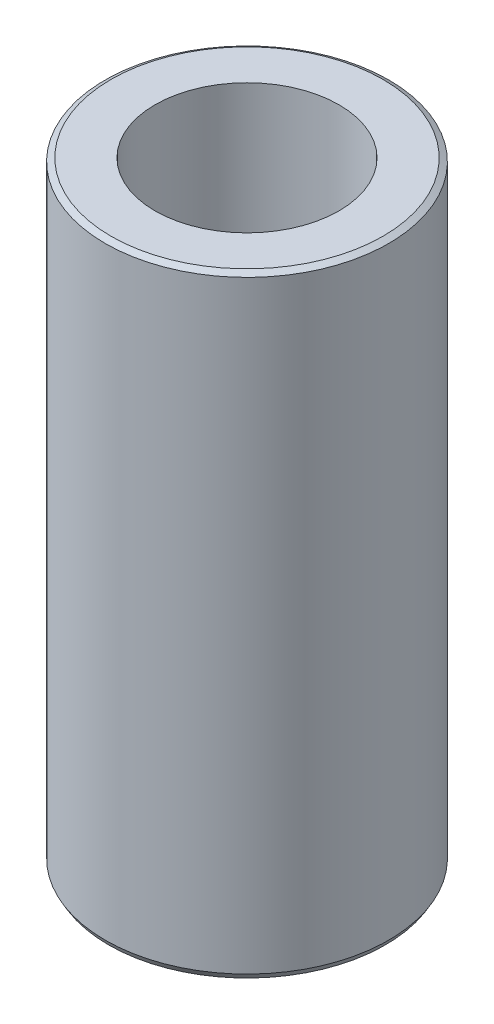
ISO-10303-21;
HEADER;
FILE_DESCRIPTION(('STEP AP214'),'2;1');
FILE_NAME('part.step','',(''),(''),'','','');
FILE_SCHEMA(('AUTOMOTIVE_DESIGN { 1 0 10303 214 1 1 1 1 }'));
ENDSEC;
DATA;
#1=APPLICATION_CONTEXT('core data for automotive mechanical design processes');
#2=APPLICATION_PROTOCOL_DEFINITION('international standard','automotive_design',2000,#1);
#3=PRODUCT_CONTEXT('',#1,'mechanical');
#4=PRODUCT('Part','Part','',(#3));
#5=PRODUCT_RELATED_PRODUCT_CATEGORY('part','',(#4));
#6=PRODUCT_DEFINITION_FORMATION('','',#4);
#7=PRODUCT_DEFINITION_CONTEXT('part definition',#1,'design');
#8=PRODUCT_DEFINITION('design','',#6,#7);
#9=PRODUCT_DEFINITION_SHAPE('','',#8);
#10=(LENGTH_UNIT() NAMED_UNIT(*) SI_UNIT(.MILLI.,.METRE.));
#11=(NAMED_UNIT(*) PLANE_ANGLE_UNIT() SI_UNIT($,.RADIAN.));
#12=(NAMED_UNIT(*) SI_UNIT($,.STERADIAN.) SOLID_ANGLE_UNIT());
#13=UNCERTAINTY_MEASURE_WITH_UNIT(LENGTH_MEASURE(1.E-05),#10,'distance_accuracy_value','');
#14=(GEOMETRIC_REPRESENTATION_CONTEXT(3) GLOBAL_UNCERTAINTY_ASSIGNED_CONTEXT((#13)) GLOBAL_UNIT_ASSIGNED_CONTEXT((#10,
#11,#12)) REPRESENTATION_CONTEXT('',''));
#15=CARTESIAN_POINT('',(0.,0.,0.));
#16=DIRECTION('',(0.,0.,1.));
#17=DIRECTION('',(1.,0.,0.));
#18=AXIS2_PLACEMENT_3D('',#15,#16,#17);
#19=CARTESIAN_POINT('',(0.,216.085897485748,0.));
#20=DIRECTION('',(0.,-1.,0.));
#21=DIRECTION('',(0.,0.,-1.));
#22=AXIS2_PLACEMENT_3D('',#19,#20,#21);
#23=CYLINDRICAL_SURFACE('',#22,50.);
#24=CARTESIAN_POINT('',(0.,214.903749610509,0.));
#25=DIRECTION('',(0.,1.,0.));
#26=DIRECTION('',(0.,0.,1.));
#27=AXIS2_PLACEMENT_3D('',#24,#25,#26);
#28=CIRCLE('',#27,50.);
#29=CARTESIAN_POINT('',(0.,214.903749610509,50.));
#30=VERTEX_POINT('',#29);
#31=EDGE_CURVE('E50',#30,#30,#28,.F.);
#32=ORIENTED_EDGE('',*,*,#31,.T.);
#33=EDGE_LOOP('',(#32));
#34=FACE_BOUND('',#33,.T.);
#35=CARTESIAN_POINT('',(0.,2.04754018197448,0.));
#36=DIRECTION('',(0.,1.,0.));
#37=DIRECTION('',(0.,0.,1.));
#38=AXIS2_PLACEMENT_3D('',#35,#36,#37);
#39=CIRCLE('',#38,50.);
#40=CARTESIAN_POINT('',(0.,2.04754018197448,50.));
#41=VERTEX_POINT('',#40);
#42=EDGE_CURVE('E51',#41,#41,#39,.T.);
#43=ORIENTED_EDGE('',*,*,#42,.T.);
#44=EDGE_LOOP('',(#43));
#45=FACE_BOUND('',#44,.T.);
#46=ADVANCED_FACE('F39',(#34,#45),#23,.T.);
#47=CARTESIAN_POINT('',(0.,216.085897485748,0.));
#48=DIRECTION('',(0.,1.,0.));
#49=DIRECTION('',(0.,0.,1.));
#50=AXIS2_PLACEMENT_3D('',#47,#48,#49);
#51=PLANE('',#50);
#52=CARTESIAN_POINT('',(0.,216.085897485748,0.));
#53=DIRECTION('',(0.,1.,0.));
#54=DIRECTION('',(0.,0.,1.));
#55=AXIS2_PLACEMENT_3D('',#52,#53,#54);
#56=CIRCLE('',#55,47.9524598180256);
#57=CARTESIAN_POINT('',(0.,216.085897485748,47.9524598180256));
#58=VERTEX_POINT('',#57);
#59=EDGE_CURVE('E54',#58,#58,#56,.T.);
#60=ORIENTED_EDGE('',*,*,#59,.T.);
#61=EDGE_LOOP('',(#60));
#62=FACE_BOUND('',#61,.T.);
#63=CARTESIAN_POINT('',(0.,216.085897485748,0.));
#64=DIRECTION('',(0.,1.,0.));
#65=DIRECTION('',(0.,0.,1.));
#66=AXIS2_PLACEMENT_3D('',#63,#64,#65);
#67=CIRCLE('',#66,32.4467983172391);
#68=CARTESIAN_POINT('',(0.,216.085897485748,32.4467983172391));
#69=VERTEX_POINT('',#68);
#70=EDGE_CURVE('E58',#69,#69,#67,.T.);
#71=ORIENTED_EDGE('',*,*,#70,.F.);
#72=EDGE_LOOP('',(#71));
#73=FACE_BOUND('',#72,.T.);
#74=ADVANCED_FACE('F69',(#62,#73),#51,.T.);
#75=CARTESIAN_POINT('',(0.,0.,0.));
#76=DIRECTION('',(0.,1.,0.));
#77=DIRECTION('',(0.,0.,1.));
#78=AXIS2_PLACEMENT_3D('',#75,#76,#77);
#79=PLANE('',#78);
#80=CARTESIAN_POINT('',(0.,0.,0.));
#81=DIRECTION('',(0.,1.,0.));
#82=DIRECTION('',(0.,0.,1.));
#83=AXIS2_PLACEMENT_3D('',#80,#81,#82);
#84=CIRCLE('',#83,48.8178521247604);
#85=CARTESIAN_POINT('',(0.,0.,48.8178521247604));
#86=VERTEX_POINT('',#85);
#87=EDGE_CURVE('E10',#86,#86,#84,.F.);
#88=ORIENTED_EDGE('',*,*,#87,.T.);
#89=EDGE_LOOP('',(#88));
#90=FACE_BOUND('',#89,.T.);
#91=CARTESIAN_POINT('',(0.,0.,0.));
#92=DIRECTION('',(0.,1.,0.));
#93=DIRECTION('',(0.,0.,1.));
#94=AXIS2_PLACEMENT_3D('',#91,#92,#93);
#95=CIRCLE('',#94,32.4467983172391);
#96=CARTESIAN_POINT('',(0.,0.,32.4467983172391));
#97=VERTEX_POINT('',#96);
#98=EDGE_CURVE('E63',#97,#97,#95,.T.);
#99=ORIENTED_EDGE('',*,*,#98,.T.);
#100=EDGE_LOOP('',(#99));
#101=FACE_BOUND('',#100,.T.);
#102=ADVANCED_FACE('F75',(#90,#101),#79,.F.);
#103=CARTESIAN_POINT('',(0.,216.085897485748,0.));
#104=DIRECTION('',(0.,-1.,0.));
#105=DIRECTION('',(0.,0.,-1.));
#106=AXIS2_PLACEMENT_3D('',#103,#104,#105);
#107=CYLINDRICAL_SURFACE('',#106,32.4467983172391);
#108=ORIENTED_EDGE('',*,*,#70,.T.);
#109=EDGE_LOOP('',(#108));
#110=FACE_BOUND('',#109,.T.);
#111=ORIENTED_EDGE('',*,*,#98,.F.);
#112=EDGE_LOOP('',(#111));
#113=FACE_BOUND('',#112,.T.);
#114=ADVANCED_FACE('F70',(#110,#113),#107,.F.);
#115=CARTESIAN_POINT('',(0.,216.085897485748,0.));
#116=DIRECTION('',(0.,-1.,0.));
#117=DIRECTION('',(0.,0.,-1.));
#118=AXIS2_PLACEMENT_3D('',#115,#116,#117);
#119=CONICAL_SURFACE('',#118,47.9524598180256,1.04719755119659);
#120=ORIENTED_EDGE('',*,*,#31,.F.);
#121=EDGE_LOOP('',(#120));
#122=FACE_BOUND('',#121,.T.);
#123=ORIENTED_EDGE('',*,*,#59,.F.);
#124=EDGE_LOOP('',(#123));
#125=FACE_BOUND('',#124,.T.);
#126=ADVANCED_FACE('F81',(#122,#125),#119,.T.);
#127=CARTESIAN_POINT('',(0.,2.04754018197448,0.));
#128=DIRECTION('',(0.,1.,0.));
#129=DIRECTION('',(0.,0.,1.));
#130=AXIS2_PLACEMENT_3D('',#127,#128,#129);
#131=CONICAL_SURFACE('',#130,50.,0.523598775598305);
#132=ORIENTED_EDGE('',*,*,#87,.F.);
#133=EDGE_LOOP('',(#132));
#134=FACE_BOUND('',#133,.T.);
#135=ORIENTED_EDGE('',*,*,#42,.F.);
#136=EDGE_LOOP('',(#135));
#137=FACE_BOUND('',#136,.T.);
#138=ADVANCED_FACE('F45',(#134,#137),#131,.T.);
#139=CLOSED_SHELL('',(#46,#74,#102,#114,#126,#138));
#140=MANIFOLD_SOLID_BREP('B2',#139);
#141=ADVANCED_BREP_SHAPE_REPRESENTATION('',(#18,#140),#14);
#142=SHAPE_DEFINITION_REPRESENTATION(#9,#141);
ENDSEC;
END-ISO-10303-21;
